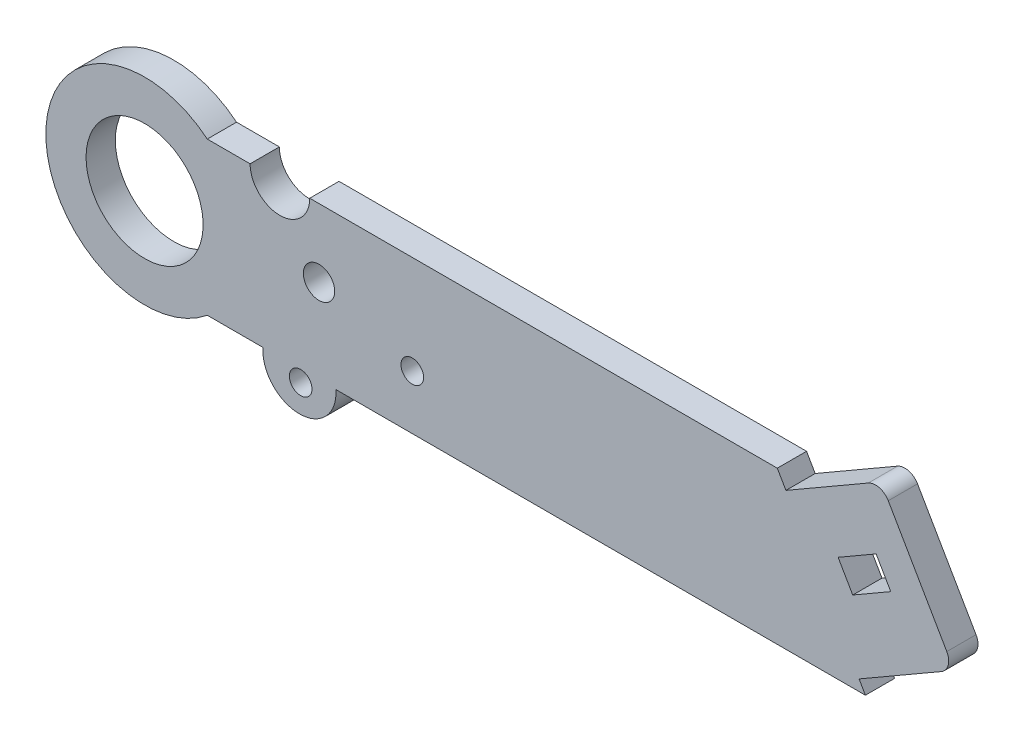
ISO-10303-21;
HEADER;
FILE_DESCRIPTION(('STEP AP214'),'2;1');
FILE_NAME('part.step','',(''),(''),'','','');
FILE_SCHEMA(('AUTOMOTIVE_DESIGN { 1 0 10303 214 1 1 1 1 }'));
ENDSEC;
DATA;
#1=APPLICATION_CONTEXT('core data for automotive mechanical design processes');
#2=APPLICATION_PROTOCOL_DEFINITION('international standard','automotive_design',2000,#1);
#3=PRODUCT_CONTEXT('',#1,'mechanical');
#4=PRODUCT('Part','Part','',(#3));
#5=PRODUCT_RELATED_PRODUCT_CATEGORY('part','',(#4));
#6=PRODUCT_DEFINITION_FORMATION('','',#4);
#7=PRODUCT_DEFINITION_CONTEXT('part definition',#1,'design');
#8=PRODUCT_DEFINITION('design','',#6,#7);
#9=PRODUCT_DEFINITION_SHAPE('','',#8);
#10=(LENGTH_UNIT() NAMED_UNIT(*) SI_UNIT(.MILLI.,.METRE.));
#11=(NAMED_UNIT(*) PLANE_ANGLE_UNIT() SI_UNIT($,.RADIAN.));
#12=(NAMED_UNIT(*) SI_UNIT($,.STERADIAN.) SOLID_ANGLE_UNIT());
#13=UNCERTAINTY_MEASURE_WITH_UNIT(LENGTH_MEASURE(1.E-05),#10,'distance_accuracy_value','');
#14=(GEOMETRIC_REPRESENTATION_CONTEXT(3) GLOBAL_UNCERTAINTY_ASSIGNED_CONTEXT((#13)) GLOBAL_UNIT_ASSIGNED_CONTEXT((#10,
#11,#12)) REPRESENTATION_CONTEXT('',''));
#15=CARTESIAN_POINT('',(0.,0.,0.));
#16=DIRECTION('',(0.,0.,1.));
#17=DIRECTION('',(1.,0.,0.));
#18=AXIS2_PLACEMENT_3D('',#15,#16,#17);
#19=CARTESIAN_POINT('',(28.5705507322346,-10.430515814004,4.));
#20=DIRECTION('',(0.,1.,0.));
#21=DIRECTION('',(-1.,0.,0.));
#22=AXIS2_PLACEMENT_3D('',#19,#20,#21);
#23=PLANE('',#22);
#24=DIRECTION('',(1.,0.,0.));
#25=VECTOR('',#24,1.);
#26=CARTESIAN_POINT('',(28.5705507322346,-10.430515814004,0.));
#27=LINE('',#26,#25);
#28=CARTESIAN_POINT('',(-71.4294492677657,-10.4305158140035,0.));
#29=VERTEX_POINT('',#28);
#30=CARTESIAN_POINT('',(-63.8151403933771,-10.4305158140038,0.));
#31=VERTEX_POINT('',#30);
#32=EDGE_CURVE('E171',#29,#31,#27,.T.);
#33=ORIENTED_EDGE('',*,*,#32,.T.);
#34=DIRECTION('',(0.,0.,1.));
#35=VECTOR('',#34,1.);
#36=CARTESIAN_POINT('',(-63.815140393377,-10.4305158140035,-11.3544213414863));
#37=LINE('',#36,#35);
#38=CARTESIAN_POINT('',(-63.8151403933771,-10.4305158140038,4.));
#39=VERTEX_POINT('',#38);
#40=EDGE_CURVE('E58',#31,#39,#37,.T.);
#41=ORIENTED_EDGE('',*,*,#40,.T.);
#42=DIRECTION('',(1.,0.,0.));
#43=VECTOR('',#42,1.);
#44=CARTESIAN_POINT('',(28.5705507322346,-10.430515814004,4.));
#45=LINE('',#44,#43);
#46=CARTESIAN_POINT('',(-71.4294492677657,-10.4305158140035,4.));
#47=VERTEX_POINT('',#46);
#48=EDGE_CURVE('E297',#47,#39,#45,.T.);
#49=ORIENTED_EDGE('',*,*,#48,.F.);
#50=DIRECTION('',(0.,0.,-1.));
#51=VECTOR('',#50,1.);
#52=CARTESIAN_POINT('',(-71.4294492677657,-10.4305158140035,4.));
#53=LINE('',#52,#51);
#54=EDGE_CURVE('E299',#47,#29,#53,.T.);
#55=ORIENTED_EDGE('',*,*,#54,.T.);
#56=EDGE_LOOP('',(#33,#41,#49,#55));
#57=FACE_BOUND('',#56,.T.);
#58=ADVANCED_FACE('F35',(#57),#23,.F.);
#59=CARTESIAN_POINT('',(28.5705507322346,-2.23779328401008E-13,4.));
#60=DIRECTION('',(0.,0.,-1.));
#61=DIRECTION('',(-1.,0.,0.));
#62=AXIS2_PLACEMENT_3D('',#59,#60,#61);
#63=PLANE('',#62);
#64=CARTESIAN_POINT('',(-58.6634492677657,-12.0125158140035,4.));
#65=DIRECTION('',(0.,0.,1.));
#66=DIRECTION('',(1.,0.,0.));
#67=AXIS2_PLACEMENT_3D('',#64,#65,#66);
#68=CIRCLE('',#67,1.55);
#69=CARTESIAN_POINT('',(-57.1134492677657,-12.0125158140035,4.));
#70=VERTEX_POINT('',#69);
#71=EDGE_CURVE('E181',#70,#70,#68,.T.);
#72=ORIENTED_EDGE('',*,*,#71,.F.);
#73=EDGE_LOOP('',(#72));
#74=FACE_BOUND('',#73,.T.);
#75=CARTESIAN_POINT('',(-43.4044492677657,-3.02551581400346,4.));
#76=DIRECTION('',(0.,0.,1.));
#77=DIRECTION('',(1.,0.,0.));
#78=AXIS2_PLACEMENT_3D('',#75,#76,#77);
#79=CIRCLE('',#78,1.55);
#80=CARTESIAN_POINT('',(-41.8544492677657,-3.02551581400346,4.));
#81=VERTEX_POINT('',#80);
#82=EDGE_CURVE('E458',#81,#81,#79,.T.);
#83=ORIENTED_EDGE('',*,*,#82,.F.);
#84=EDGE_LOOP('',(#83));
#85=FACE_BOUND('',#84,.T.);
#86=CARTESIAN_POINT('',(19.9282032302755,13.1579414541164,4.));
#87=DIRECTION('',(0.,0.,-1.));
#88=DIRECTION('',(-1.,0.,0.));
#89=AXIS2_PLACEMENT_3D('',#86,#87,#88);
#90=CIRCLE('',#89,2.);
#91=CARTESIAN_POINT('',(18.9282032302755,14.8899922616853,4.));
#92=VERTEX_POINT('',#91);
#93=CARTESIAN_POINT('',(21.6602540378444,14.1579414541164,4.));
#94=VERTEX_POINT('',#93);
#95=EDGE_CURVE('E191',#92,#94,#90,.T.);
#96=ORIENTED_EDGE('',*,*,#95,.F.);
#97=DIRECTION('',(0.866025403784439,0.5,0.));
#98=VECTOR('',#97,1.);
#99=CARTESIAN_POINT('',(18.9282032302755,14.8899922616853,4.));
#100=LINE('',#99,#98);
#101=CARTESIAN_POINT('',(7.66987298107778,8.38999226168531,4.));
#102=VERTEX_POINT('',#101);
#103=EDGE_CURVE('E200',#102,#92,#100,.T.);
#104=ORIENTED_EDGE('',*,*,#103,.F.);
#105=DIRECTION('',(0.5,-0.866025403784439,0.));
#106=VECTOR('',#105,1.);
#107=CARTESIAN_POINT('',(5.71913664723049,11.7687667040795,4.));
#108=LINE('',#107,#106);
#109=CARTESIAN_POINT('',(6.49177615885906,10.4305158140036,4.));
#110=VERTEX_POINT('',#109);
#111=EDGE_CURVE('E241',#110,#102,#108,.T.);
#112=ORIENTED_EDGE('',*,*,#111,.F.);
#113=DIRECTION('',(-1.,0.,0.));
#114=VECTOR('',#113,1.);
#115=CARTESIAN_POINT('',(-57.4234990357657,10.4305158140038,4.));
#116=LINE('',#115,#114);
#117=CARTESIAN_POINT('',(-57.4234990357657,10.4305158140038,4.));
#118=VERTEX_POINT('',#117);
#119=EDGE_CURVE('E289',#110,#118,#116,.T.);
#120=ORIENTED_EDGE('',*,*,#119,.T.);
#121=CARTESIAN_POINT('',(-61.4993944199065,10.4305158140038,4.));
#122=DIRECTION('',(0.,0.,-1.));
#123=DIRECTION('',(1.,0.,0.));
#124=AXIS2_PLACEMENT_3D('',#121,#122,#123);
#125=CIRCLE('',#124,4.07589538414074);
#126=CARTESIAN_POINT('',(-65.5752898040472,10.4305158140038,4.));
#127=VERTEX_POINT('',#126);
#128=EDGE_CURVE('E291',#118,#127,#125,.T.);
#129=ORIENTED_EDGE('',*,*,#128,.T.);
#130=DIRECTION('',(-1.,0.,0.));
#131=VECTOR('',#130,1.);
#132=CARTESIAN_POINT('',(-71.4294492677654,10.4305158140038,4.));
#133=LINE('',#132,#131);
#134=CARTESIAN_POINT('',(-71.4294492677654,10.4305158140038,4.));
#135=VERTEX_POINT('',#134);
#136=EDGE_CURVE('E293',#127,#135,#133,.T.);
#137=ORIENTED_EDGE('',*,*,#136,.T.);
#138=CARTESIAN_POINT('',(-80.0000000000002,4.8919202022546E-13,4.));
#139=DIRECTION('',(0.,0.,1.));
#140=DIRECTION('',(1.,0.,0.));
#141=AXIS2_PLACEMENT_3D('',#138,#139,#140);
#142=CIRCLE('',#141,13.4999999999997);
#143=EDGE_CURVE('E295',#135,#47,#142,.T.);
#144=ORIENTED_EDGE('',*,*,#143,.T.);
#145=ORIENTED_EDGE('',*,*,#48,.T.);
#146=CARTESIAN_POINT('',(-58.8294492677657,-10.8085158140035,4.));
#147=DIRECTION('',(0.,0.,1.));
#148=DIRECTION('',(1.,0.,0.));
#149=AXIS2_PLACEMENT_3D('',#146,#147,#148);
#150=CIRCLE('',#149,5.);
#151=CARTESIAN_POINT('',(-53.8437581421543,-10.4305158140038,4.));
#152=VERTEX_POINT('',#151);
#153=EDGE_CURVE('E188',#39,#152,#150,.T.);
#154=ORIENTED_EDGE('',*,*,#153,.T.);
#155=CARTESIAN_POINT('',(18.5358983848625,-10.4305158140039,4.));
#156=VERTEX_POINT('',#155);
#157=EDGE_CURVE('E50',#152,#156,#45,.T.);
#158=ORIENTED_EDGE('',*,*,#157,.T.);
#159=DIRECTION('',(0.5,-0.866025403784439,0.));
#160=VECTOR('',#159,1.);
#161=CARTESIAN_POINT('',(17.6698729810778,-8.93051581400346,4.));
#162=LINE('',#161,#160);
#163=CARTESIAN_POINT('',(17.6698729810778,-8.93051581400346,4.));
#164=VERTEX_POINT('',#163);
#165=EDGE_CURVE('E225',#164,#156,#162,.T.);
#166=ORIENTED_EDGE('',*,*,#165,.F.);
#167=DIRECTION('',(-0.866025403784438,-0.5,0.));
#168=VECTOR('',#167,1.);
#169=CARTESIAN_POINT('',(17.6698729810778,-8.93051581400346,4.));
#170=LINE('',#169,#168);
#171=CARTESIAN_POINT('',(28.9282032302755,-2.43051581400346,4.));
#172=VERTEX_POINT('',#171);
#173=EDGE_CURVE('E222',#172,#164,#170,.T.);
#174=ORIENTED_EDGE('',*,*,#173,.F.);
#175=CARTESIAN_POINT('',(27.9282032302755,-0.698465006434585,4.));
#176=DIRECTION('',(0.,0.,-1.));
#177=DIRECTION('',(-1.,0.,0.));
#178=AXIS2_PLACEMENT_3D('',#175,#176,#177);
#179=CIRCLE('',#178,2.);
#180=CARTESIAN_POINT('',(29.6602540378444,0.301534993565415,4.));
#181=VERTEX_POINT('',#180);
#182=EDGE_CURVE('E198',#181,#172,#179,.T.);
#183=ORIENTED_EDGE('',*,*,#182,.F.);
#184=DIRECTION('',(0.5,-0.866025403784439,0.));
#185=VECTOR('',#184,1.);
#186=CARTESIAN_POINT('',(21.6602540378444,14.1579414541164,4.));
#187=LINE('',#186,#185);
#188=EDGE_CURVE('E194',#94,#181,#187,.T.);
#189=ORIENTED_EDGE('',*,*,#188,.F.);
#190=EDGE_LOOP('',(#96,#104,#112,#120,#129,#137,#144,#145,#154,#158,#166,#174,#183,#189));
#191=FACE_BOUND('',#190,.T.);
#192=CARTESIAN_POINT('',(-56.1528243140113,1.10586946070457,4.));
#193=DIRECTION('',(0.,0.,1.));
#194=DIRECTION('',(1.,0.,0.));
#195=AXIS2_PLACEMENT_3D('',#192,#193,#194);
#196=CIRCLE('',#195,2.14132169694266);
#197=CARTESIAN_POINT('',(-54.0115026170686,1.10586946070457,4.));
#198=VERTEX_POINT('',#197);
#199=EDGE_CURVE('E256',#198,#198,#196,.T.);
#200=ORIENTED_EDGE('',*,*,#199,.F.);
#201=EDGE_LOOP('',(#200));
#202=FACE_BOUND('',#201,.T.);
#203=DIRECTION('',(0.866025403784436,0.500000000000004,0.));
#204=VECTOR('',#203,1.);
#205=CARTESIAN_POINT('',(14.8038475772934,4.03358580113426,4.));
#206=LINE('',#205,#204);
#207=CARTESIAN_POINT('',(14.8038475772934,4.03358580113426,4.));
#208=VERTEX_POINT('',#207);
#209=CARTESIAN_POINT('',(20.,7.03358580113428,4.));
#210=VERTEX_POINT('',#209);
#211=EDGE_CURVE('E280',#208,#210,#206,.T.);
#212=ORIENTED_EDGE('',*,*,#211,.T.);
#213=DIRECTION('',(0.500000000000004,-0.866025403784436,0.));
#214=VECTOR('',#213,1.);
#215=CARTESIAN_POINT('',(20.,7.03358580113428,4.));
#216=LINE('',#215,#214);
#217=CARTESIAN_POINT('',(22.,3.56948418599654,4.));
#218=VERTEX_POINT('',#217);
#219=EDGE_CURVE('E277',#210,#218,#216,.T.);
#220=ORIENTED_EDGE('',*,*,#219,.T.);
#221=DIRECTION('',(0.866025403784436,0.500000000000005,0.));
#222=VECTOR('',#221,1.);
#223=CARTESIAN_POINT('',(16.8038475772934,0.569484185996512,4.));
#224=LINE('',#223,#222);
#225=CARTESIAN_POINT('',(16.8038475772934,0.569484185996512,4.));
#226=VERTEX_POINT('',#225);
#227=EDGE_CURVE('E274',#226,#218,#224,.T.);
#228=ORIENTED_EDGE('',*,*,#227,.F.);
#229=DIRECTION('',(0.500000000000005,-0.866025403784436,0.));
#230=VECTOR('',#229,1.);
#231=CARTESIAN_POINT('',(14.8038475772934,4.03358580113426,4.));
#232=LINE('',#231,#230);
#233=EDGE_CURVE('E271',#208,#226,#232,.T.);
#234=ORIENTED_EDGE('',*,*,#233,.F.);
#235=EDGE_LOOP('',(#212,#220,#228,#234));
#236=FACE_BOUND('',#235,.T.);
#237=CARTESIAN_POINT('',(-80.,0.,4.));
#238=DIRECTION('',(0.,0.,-1.));
#239=DIRECTION('',(-1.,0.,0.));
#240=AXIS2_PLACEMENT_3D('',#237,#238,#239);
#241=CIRCLE('',#240,8.);
#242=CARTESIAN_POINT('',(-88.,0.,4.));
#243=VERTEX_POINT('',#242);
#244=EDGE_CURVE('E246',#243,#243,#241,.T.);
#245=ORIENTED_EDGE('',*,*,#244,.T.);
#246=EDGE_LOOP('',(#245));
#247=FACE_BOUND('',#246,.T.);
#248=ADVANCED_FACE('F328',(#74,#85,#191,#202,#236,#247),#63,.F.);
#249=CARTESIAN_POINT('',(28.5705507322346,-2.23779328401008E-13,0.));
#250=DIRECTION('',(0.,0.,-1.));
#251=DIRECTION('',(-1.,0.,0.));
#252=AXIS2_PLACEMENT_3D('',#249,#250,#251);
#253=PLANE('',#252);
#254=CARTESIAN_POINT('',(-58.6634492677657,-12.0125158140035,0.));
#255=DIRECTION('',(0.,0.,-1.));
#256=DIRECTION('',(-1.,0.,0.));
#257=AXIS2_PLACEMENT_3D('',#254,#255,#256);
#258=CIRCLE('',#257,1.55);
#259=CARTESIAN_POINT('',(-60.2134492677657,-12.0125158140035,0.));
#260=VERTEX_POINT('',#259);
#261=EDGE_CURVE('E184',#260,#260,#258,.F.);
#262=ORIENTED_EDGE('',*,*,#261,.T.);
#263=EDGE_LOOP('',(#262));
#264=FACE_BOUND('',#263,.T.);
#265=CARTESIAN_POINT('',(-43.4044492677657,-3.02551581400346,0.));
#266=DIRECTION('',(0.,0.,-1.));
#267=DIRECTION('',(-1.,0.,0.));
#268=AXIS2_PLACEMENT_3D('',#265,#266,#267);
#269=CIRCLE('',#268,1.55);
#270=CARTESIAN_POINT('',(-44.9544492677657,-3.02551581400346,0.));
#271=VERTEX_POINT('',#270);
#272=EDGE_CURVE('E455',#271,#271,#269,.F.);
#273=ORIENTED_EDGE('',*,*,#272,.T.);
#274=EDGE_LOOP('',(#273));
#275=FACE_BOUND('',#274,.T.);
#276=DIRECTION('',(0.866025403784439,0.5,0.));
#277=VECTOR('',#276,1.);
#278=CARTESIAN_POINT('',(18.9282032302755,14.8899922616853,0.));
#279=LINE('',#278,#277);
#280=CARTESIAN_POINT('',(7.66987298107778,8.38999226168531,0.));
#281=VERTEX_POINT('',#280);
#282=CARTESIAN_POINT('',(18.9282032302755,14.8899922616853,0.));
#283=VERTEX_POINT('',#282);
#284=EDGE_CURVE('E238',#281,#283,#279,.T.);
#285=ORIENTED_EDGE('',*,*,#284,.T.);
#286=CARTESIAN_POINT('',(19.9282032302755,13.1579414541164,0.));
#287=DIRECTION('',(0.,0.,1.));
#288=DIRECTION('',(-1.,0.,0.));
#289=AXIS2_PLACEMENT_3D('',#286,#287,#288);
#290=CIRCLE('',#289,2.);
#291=CARTESIAN_POINT('',(21.6602540378444,14.1579414541164,0.));
#292=VERTEX_POINT('',#291);
#293=EDGE_CURVE('E207',#292,#283,#290,.T.);
#294=ORIENTED_EDGE('',*,*,#293,.F.);
#295=DIRECTION('',(-0.5,0.866025403784439,0.));
#296=VECTOR('',#295,1.);
#297=CARTESIAN_POINT('',(21.6602540378444,14.1579414541164,0.));
#298=LINE('',#297,#296);
#299=CARTESIAN_POINT('',(29.6602540378444,0.301534993565416,0.));
#300=VERTEX_POINT('',#299);
#301=EDGE_CURVE('E204',#300,#292,#298,.T.);
#302=ORIENTED_EDGE('',*,*,#301,.F.);
#303=CARTESIAN_POINT('',(27.9282032302755,-0.698465006434585,0.));
#304=DIRECTION('',(0.,0.,1.));
#305=DIRECTION('',(1.,0.,0.));
#306=AXIS2_PLACEMENT_3D('',#303,#304,#305);
#307=CIRCLE('',#306,2.);
#308=CARTESIAN_POINT('',(28.9282032302755,-2.43051581400346,0.));
#309=VERTEX_POINT('',#308);
#310=EDGE_CURVE('E201',#309,#300,#307,.T.);
#311=ORIENTED_EDGE('',*,*,#310,.F.);
#312=DIRECTION('',(-0.866025403784438,-0.5,0.));
#313=VECTOR('',#312,1.);
#314=CARTESIAN_POINT('',(17.6698729810778,-8.93051581400346,0.));
#315=LINE('',#314,#313);
#316=CARTESIAN_POINT('',(17.6698729810778,-8.93051581400346,0.));
#317=VERTEX_POINT('',#316);
#318=EDGE_CURVE('E218',#309,#317,#315,.T.);
#319=ORIENTED_EDGE('',*,*,#318,.T.);
#320=DIRECTION('',(0.5,-0.866025403784439,0.));
#321=VECTOR('',#320,1.);
#322=CARTESIAN_POINT('',(17.6698729810778,-8.93051581400346,0.));
#323=LINE('',#322,#321);
#324=CARTESIAN_POINT('',(18.5358983848625,-10.4305158140039,0.));
#325=VERTEX_POINT('',#324);
#326=EDGE_CURVE('E169',#317,#325,#323,.T.);
#327=ORIENTED_EDGE('',*,*,#326,.T.);
#328=CARTESIAN_POINT('',(-53.8437581421543,-10.4305158140035,0.));
#329=VERTEX_POINT('',#328);
#330=EDGE_CURVE('E162',#329,#325,#27,.T.);
#331=ORIENTED_EDGE('',*,*,#330,.F.);
#332=CARTESIAN_POINT('',(-58.8294492677657,-10.8085158140035,0.));
#333=DIRECTION('',(0.,0.,-1.));
#334=DIRECTION('',(-1.,0.,0.));
#335=AXIS2_PLACEMENT_3D('',#332,#333,#334);
#336=CIRCLE('',#335,5.);
#337=EDGE_CURVE('E167',#31,#329,#336,.F.);
#338=ORIENTED_EDGE('',*,*,#337,.F.);
#339=ORIENTED_EDGE('',*,*,#32,.F.);
#340=CARTESIAN_POINT('',(-80.0000000000002,4.8919202022546E-13,0.));
#341=DIRECTION('',(0.,0.,1.));
#342=DIRECTION('',(1.,0.,0.));
#343=AXIS2_PLACEMENT_3D('',#340,#341,#342);
#344=CIRCLE('',#343,13.4999999999997);
#345=CARTESIAN_POINT('',(-71.4294492677654,10.4305158140038,0.));
#346=VERTEX_POINT('',#345);
#347=EDGE_CURVE('E172',#346,#29,#344,.T.);
#348=ORIENTED_EDGE('',*,*,#347,.F.);
#349=DIRECTION('',(-1.,0.,0.));
#350=VECTOR('',#349,1.);
#351=CARTESIAN_POINT('',(-71.4294492677654,10.4305158140038,0.));
#352=LINE('',#351,#350);
#353=CARTESIAN_POINT('',(-65.5752898040472,10.4305158140038,0.));
#354=VERTEX_POINT('',#353);
#355=EDGE_CURVE('E303',#354,#346,#352,.T.);
#356=ORIENTED_EDGE('',*,*,#355,.F.);
#357=CARTESIAN_POINT('',(-61.4993944199065,10.4305158140038,0.));
#358=DIRECTION('',(0.,0.,-1.));
#359=DIRECTION('',(1.,0.,0.));
#360=AXIS2_PLACEMENT_3D('',#357,#358,#359);
#361=CIRCLE('',#360,4.07589538414074);
#362=CARTESIAN_POINT('',(-57.4234990357657,10.4305158140038,0.));
#363=VERTEX_POINT('',#362);
#364=EDGE_CURVE('E301',#363,#354,#361,.T.);
#365=ORIENTED_EDGE('',*,*,#364,.F.);
#366=DIRECTION('',(-1.,0.,0.));
#367=VECTOR('',#366,1.);
#368=CARTESIAN_POINT('',(-57.4234990357657,10.4305158140038,0.));
#369=LINE('',#368,#367);
#370=CARTESIAN_POINT('',(6.49177615885907,10.4305158140036,0.));
#371=VERTEX_POINT('',#370);
#372=EDGE_CURVE('E253',#371,#363,#369,.T.);
#373=ORIENTED_EDGE('',*,*,#372,.F.);
#374=DIRECTION('',(0.5,-0.866025403784439,0.));
#375=VECTOR('',#374,1.);
#376=CARTESIAN_POINT('',(5.71913664723049,11.7687667040795,0.));
#377=LINE('',#376,#375);
#378=EDGE_CURVE('E234',#371,#281,#377,.T.);
#379=ORIENTED_EDGE('',*,*,#378,.T.);
#380=EDGE_LOOP('',(#285,#294,#302,#311,#319,#327,#331,#338,#339,#348,#356,#365,#373,#379));
#381=FACE_BOUND('',#380,.T.);
#382=DIRECTION('',(0.500000000000004,-0.866025403784436,0.));
#383=VECTOR('',#382,1.);
#384=CARTESIAN_POINT('',(20.,7.03358580113428,0.));
#385=LINE('',#384,#383);
#386=CARTESIAN_POINT('',(20.,7.03358580113428,0.));
#387=VERTEX_POINT('',#386);
#388=CARTESIAN_POINT('',(22.,3.56948418599654,0.));
#389=VERTEX_POINT('',#388);
#390=EDGE_CURVE('E285',#387,#389,#385,.T.);
#391=ORIENTED_EDGE('',*,*,#390,.F.);
#392=DIRECTION('',(0.866025403784436,0.500000000000004,0.));
#393=VECTOR('',#392,1.);
#394=CARTESIAN_POINT('',(14.8038475772934,4.03358580113426,0.));
#395=LINE('',#394,#393);
#396=CARTESIAN_POINT('',(14.8038475772934,4.03358580113426,0.));
#397=VERTEX_POINT('',#396);
#398=EDGE_CURVE('E283',#397,#387,#395,.T.);
#399=ORIENTED_EDGE('',*,*,#398,.F.);
#400=DIRECTION('',(0.500000000000005,-0.866025403784436,0.));
#401=VECTOR('',#400,1.);
#402=CARTESIAN_POINT('',(14.8038475772934,4.03358580113426,0.));
#403=LINE('',#402,#401);
#404=CARTESIAN_POINT('',(16.8038475772934,0.569484185996512,0.));
#405=VERTEX_POINT('',#404);
#406=EDGE_CURVE('E231',#397,#405,#403,.T.);
#407=ORIENTED_EDGE('',*,*,#406,.T.);
#408=DIRECTION('',(0.866025403784436,0.500000000000005,0.));
#409=VECTOR('',#408,1.);
#410=CARTESIAN_POINT('',(16.8038475772934,0.569484185996512,0.));
#411=LINE('',#410,#409);
#412=EDGE_CURVE('E259',#405,#389,#411,.T.);
#413=ORIENTED_EDGE('',*,*,#412,.T.);
#414=EDGE_LOOP('',(#391,#399,#407,#413));
#415=FACE_BOUND('',#414,.T.);
#416=CARTESIAN_POINT('',(-56.1528243140113,1.10586946070457,0.));
#417=DIRECTION('',(0.,0.,-1.));
#418=DIRECTION('',(-1.,0.,0.));
#419=AXIS2_PLACEMENT_3D('',#416,#417,#418);
#420=CIRCLE('',#419,2.14132169694266);
#421=CARTESIAN_POINT('',(-58.294146010954,1.10586946070457,0.));
#422=VERTEX_POINT('',#421);
#423=EDGE_CURVE('E250',#422,#422,#420,.F.);
#424=ORIENTED_EDGE('',*,*,#423,.T.);
#425=EDGE_LOOP('',(#424));
#426=FACE_BOUND('',#425,.T.);
#427=CARTESIAN_POINT('',(-80.,0.,0.));
#428=DIRECTION('',(0.,0.,-1.));
#429=DIRECTION('',(-1.,0.,0.));
#430=AXIS2_PLACEMENT_3D('',#427,#428,#429);
#431=CIRCLE('',#430,8.);
#432=CARTESIAN_POINT('',(-88.,0.,0.));
#433=VERTEX_POINT('',#432);
#434=EDGE_CURVE('E249',#433,#433,#431,.T.);
#435=ORIENTED_EDGE('',*,*,#434,.F.);
#436=EDGE_LOOP('',(#435));
#437=FACE_BOUND('',#436,.T.);
#438=ADVANCED_FACE('F163',(#264,#275,#381,#415,#426,#437),#253,.T.);
#439=CARTESIAN_POINT('',(-57.4234990357657,10.4305158140038,4.));
#440=DIRECTION('',(0.,-1.,0.));
#441=DIRECTION('',(1.,0.,0.));
#442=AXIS2_PLACEMENT_3D('',#439,#440,#441);
#443=PLANE('',#442);
#444=ORIENTED_EDGE('',*,*,#119,.F.);
#445=DIRECTION('',(0.,0.,1.));
#446=VECTOR('',#445,1.);
#447=CARTESIAN_POINT('',(6.49177615885906,10.4305158140036,-0.00100000000000013));
#448=LINE('',#447,#446);
#449=EDGE_CURVE('E219',#371,#110,#448,.T.);
#450=ORIENTED_EDGE('',*,*,#449,.F.);
#451=ORIENTED_EDGE('',*,*,#372,.T.);
#452=DIRECTION('',(0.,0.,-1.));
#453=VECTOR('',#452,1.);
#454=CARTESIAN_POINT('',(-57.4234990357657,10.4305158140038,4.));
#455=LINE('',#454,#453);
#456=EDGE_CURVE('E11',#118,#363,#455,.T.);
#457=ORIENTED_EDGE('',*,*,#456,.F.);
#458=EDGE_LOOP('',(#444,#450,#451,#457));
#459=FACE_BOUND('',#458,.T.);
#460=ADVANCED_FACE('F37',(#459),#443,.F.);
#461=CARTESIAN_POINT('',(-61.4993944199065,10.4305158140038,4.));
#462=DIRECTION('',(0.,0.,-1.));
#463=DIRECTION('',(-1.,0.,0.));
#464=AXIS2_PLACEMENT_3D('',#461,#462,#463);
#465=CYLINDRICAL_SURFACE('',#464,4.07589538414074);
#466=ORIENTED_EDGE('',*,*,#364,.T.);
#467=DIRECTION('',(0.,0.,-1.));
#468=VECTOR('',#467,1.);
#469=CARTESIAN_POINT('',(-65.5752898040472,10.4305158140038,4.));
#470=LINE('',#469,#468);
#471=EDGE_CURVE('E43',#127,#354,#470,.T.);
#472=ORIENTED_EDGE('',*,*,#471,.F.);
#473=ORIENTED_EDGE('',*,*,#128,.F.);
#474=ORIENTED_EDGE('',*,*,#456,.T.);
#475=EDGE_LOOP('',(#466,#472,#473,#474));
#476=FACE_BOUND('',#475,.T.);
#477=ADVANCED_FACE('F333',(#476),#465,.F.);
#478=CARTESIAN_POINT('',(-71.4294492677654,10.4305158140038,4.));
#479=DIRECTION('',(0.,-1.,0.));
#480=DIRECTION('',(1.,0.,0.));
#481=AXIS2_PLACEMENT_3D('',#478,#479,#480);
#482=PLANE('',#481);
#483=ORIENTED_EDGE('',*,*,#355,.T.);
#484=DIRECTION('',(0.,0.,-1.));
#485=VECTOR('',#484,1.);
#486=CARTESIAN_POINT('',(-71.4294492677654,10.4305158140038,4.));
#487=LINE('',#486,#485);
#488=EDGE_CURVE('E308',#135,#346,#487,.T.);
#489=ORIENTED_EDGE('',*,*,#488,.F.);
#490=ORIENTED_EDGE('',*,*,#136,.F.);
#491=ORIENTED_EDGE('',*,*,#471,.T.);
#492=EDGE_LOOP('',(#483,#489,#490,#491));
#493=FACE_BOUND('',#492,.T.);
#494=ADVANCED_FACE('F315',(#493),#482,.F.);
#495=CARTESIAN_POINT('',(-80.0000000000002,4.8919202022546E-13,4.));
#496=DIRECTION('',(0.,0.,-1.));
#497=DIRECTION('',(-1.,0.,0.));
#498=AXIS2_PLACEMENT_3D('',#495,#496,#497);
#499=CYLINDRICAL_SURFACE('',#498,13.4999999999997);
#500=ORIENTED_EDGE('',*,*,#347,.T.);
#501=ORIENTED_EDGE('',*,*,#54,.F.);
#502=ORIENTED_EDGE('',*,*,#143,.F.);
#503=ORIENTED_EDGE('',*,*,#488,.T.);
#504=EDGE_LOOP('',(#500,#501,#502,#503));
#505=FACE_BOUND('',#504,.T.);
#506=ADVANCED_FACE('F324',(#505),#499,.T.);
#507=ORIENTED_EDGE('',*,*,#157,.F.);
#508=DIRECTION('',(0.,0.,1.));
#509=VECTOR('',#508,1.);
#510=CARTESIAN_POINT('',(-53.8437581421543,-10.4305158140035,-11.3544213414863));
#511=LINE('',#510,#509);
#512=EDGE_CURVE('E174',#329,#152,#511,.T.);
#513=ORIENTED_EDGE('',*,*,#512,.F.);
#514=ORIENTED_EDGE('',*,*,#330,.T.);
#515=DIRECTION('',(0.,0.,-1.));
#516=VECTOR('',#515,1.);
#517=CARTESIAN_POINT('',(18.5358983848625,-10.4305158140039,-0.00100000000000013));
#518=LINE('',#517,#516);
#519=EDGE_CURVE('E216',#156,#325,#518,.T.);
#520=ORIENTED_EDGE('',*,*,#519,.F.);
#521=EDGE_LOOP('',(#507,#513,#514,#520));
#522=FACE_BOUND('',#521,.T.);
#523=ADVANCED_FACE('F175',(#522),#23,.F.);
#524=CARTESIAN_POINT('',(14.8038475772934,4.03358580113426,-0.00100000000000013));
#525=DIRECTION('',(0.500000000000004,-0.866025403784436,0.));
#526=DIRECTION('',(0.866025403784436,0.500000000000004,0.));
#527=AXIS2_PLACEMENT_3D('',#524,#525,#526);
#528=PLANE('',#527);
#529=ORIENTED_EDGE('',*,*,#398,.T.);
#530=DIRECTION('',(0.,0.,1.));
#531=VECTOR('',#530,1.);
#532=CARTESIAN_POINT('',(20.,7.03358580113428,-0.00100000000000013));
#533=LINE('',#532,#531);
#534=EDGE_CURVE('E262',#387,#210,#533,.T.);
#535=ORIENTED_EDGE('',*,*,#534,.T.);
#536=ORIENTED_EDGE('',*,*,#211,.F.);
#537=DIRECTION('',(0.,0.,1.));
#538=VECTOR('',#537,1.);
#539=CARTESIAN_POINT('',(14.8038475772934,4.03358580113426,-0.00100000000000013));
#540=LINE('',#539,#538);
#541=EDGE_CURVE('E268',#397,#208,#540,.T.);
#542=ORIENTED_EDGE('',*,*,#541,.F.);
#543=EDGE_LOOP('',(#529,#535,#536,#542));
#544=FACE_BOUND('',#543,.T.);
#545=ADVANCED_FACE('F383',(#544),#528,.T.);
#546=CARTESIAN_POINT('',(20.,7.03358580113428,-0.00100000000000013));
#547=DIRECTION('',(-0.866025403784436,-0.500000000000004,0.));
#548=DIRECTION('',(0.500000000000004,-0.866025403784436,0.));
#549=AXIS2_PLACEMENT_3D('',#546,#547,#548);
#550=PLANE('',#549);
#551=ORIENTED_EDGE('',*,*,#390,.T.);
#552=DIRECTION('',(0.,0.,1.));
#553=VECTOR('',#552,1.);
#554=CARTESIAN_POINT('',(22.,3.56948418599654,-0.00100000000000013));
#555=LINE('',#554,#553);
#556=EDGE_CURVE('E264',#389,#218,#555,.T.);
#557=ORIENTED_EDGE('',*,*,#556,.T.);
#558=ORIENTED_EDGE('',*,*,#219,.F.);
#559=ORIENTED_EDGE('',*,*,#534,.F.);
#560=EDGE_LOOP('',(#551,#557,#558,#559));
#561=FACE_BOUND('',#560,.T.);
#562=ADVANCED_FACE('F388',(#561),#550,.T.);
#563=CARTESIAN_POINT('',(16.8038475772934,0.569484185996512,-0.00100000000000013));
#564=DIRECTION('',(0.500000000000005,-0.866025403784436,0.));
#565=DIRECTION('',(0.866025403784436,0.500000000000005,0.));
#566=AXIS2_PLACEMENT_3D('',#563,#564,#565);
#567=PLANE('',#566);
#568=DIRECTION('',(0.,0.,1.));
#569=VECTOR('',#568,1.);
#570=CARTESIAN_POINT('',(16.8038475772934,0.569484185996512,-0.00100000000000013));
#571=LINE('',#570,#569);
#572=EDGE_CURVE('E266',#405,#226,#571,.T.);
#573=ORIENTED_EDGE('',*,*,#572,.T.);
#574=ORIENTED_EDGE('',*,*,#227,.T.);
#575=ORIENTED_EDGE('',*,*,#556,.F.);
#576=ORIENTED_EDGE('',*,*,#412,.F.);
#577=EDGE_LOOP('',(#573,#574,#575,#576));
#578=FACE_BOUND('',#577,.T.);
#579=ADVANCED_FACE('F414',(#578),#567,.F.);
#580=CARTESIAN_POINT('',(14.8038475772934,4.03358580113426,-0.00100000000000013));
#581=DIRECTION('',(-0.866025403784436,-0.500000000000005,0.));
#582=DIRECTION('',(0.500000000000005,-0.866025403784436,0.));
#583=AXIS2_PLACEMENT_3D('',#580,#581,#582);
#584=PLANE('',#583);
#585=ORIENTED_EDGE('',*,*,#541,.T.);
#586=ORIENTED_EDGE('',*,*,#233,.T.);
#587=ORIENTED_EDGE('',*,*,#572,.F.);
#588=ORIENTED_EDGE('',*,*,#406,.F.);
#589=EDGE_LOOP('',(#585,#586,#587,#588));
#590=FACE_BOUND('',#589,.T.);
#591=ADVANCED_FACE('F410',(#590),#584,.F.);
#592=CARTESIAN_POINT('',(-56.1528243140113,1.10586946070457,-0.00100000000000013));
#593=DIRECTION('',(0.,0.,1.));
#594=DIRECTION('',(1.,0.,0.));
#595=AXIS2_PLACEMENT_3D('',#592,#593,#594);
#596=CYLINDRICAL_SURFACE('',#595,2.14132169694266);
#597=ORIENTED_EDGE('',*,*,#423,.F.);
#598=EDGE_LOOP('',(#597));
#599=FACE_BOUND('',#598,.T.);
#600=ORIENTED_EDGE('',*,*,#199,.T.);
#601=EDGE_LOOP('',(#600));
#602=FACE_BOUND('',#601,.T.);
#603=ADVANCED_FACE('F413',(#599,#602),#596,.F.);
#604=CARTESIAN_POINT('',(-80.,0.,-0.00100000000000013));
#605=DIRECTION('',(0.,0.,1.));
#606=DIRECTION('',(1.,0.,0.));
#607=AXIS2_PLACEMENT_3D('',#604,#605,#606);
#608=CYLINDRICAL_SURFACE('',#607,8.);
#609=ORIENTED_EDGE('',*,*,#434,.T.);
#610=EDGE_LOOP('',(#609));
#611=FACE_BOUND('',#610,.T.);
#612=ORIENTED_EDGE('',*,*,#244,.F.);
#613=EDGE_LOOP('',(#612));
#614=FACE_BOUND('',#613,.T.);
#615=ADVANCED_FACE('F369',(#611,#614),#608,.F.);
#616=CARTESIAN_POINT('',(17.6698729810778,-8.93051581400346,-0.00100000000000013));
#617=DIRECTION('',(-0.5,0.866025403784439,0.));
#618=DIRECTION('',(-0.866025403784438,-0.5,0.));
#619=AXIS2_PLACEMENT_3D('',#616,#617,#618);
#620=PLANE('',#619);
#621=DIRECTION('',(0.,0.,1.));
#622=VECTOR('',#621,1.);
#623=CARTESIAN_POINT('',(28.9282032302755,-2.43051581400346,-0.00100000000000013));
#624=LINE('',#623,#622);
#625=EDGE_CURVE('E228',#309,#172,#624,.T.);
#626=ORIENTED_EDGE('',*,*,#625,.T.);
#627=ORIENTED_EDGE('',*,*,#173,.T.);
#628=DIRECTION('',(0.,0.,1.));
#629=VECTOR('',#628,1.);
#630=CARTESIAN_POINT('',(17.6698729810778,-8.93051581400346,-0.00100000000000013));
#631=LINE('',#630,#629);
#632=EDGE_CURVE('E229',#317,#164,#631,.T.);
#633=ORIENTED_EDGE('',*,*,#632,.F.);
#634=ORIENTED_EDGE('',*,*,#318,.F.);
#635=EDGE_LOOP('',(#626,#627,#633,#634));
#636=FACE_BOUND('',#635,.T.);
#637=ADVANCED_FACE('F357',(#636),#620,.F.);
#638=CARTESIAN_POINT('',(17.6698729810778,-8.93051581400346,-0.00100000000000013));
#639=DIRECTION('',(-0.866025403784439,-0.5,0.));
#640=DIRECTION('',(0.5,-0.866025403784439,0.));
#641=AXIS2_PLACEMENT_3D('',#638,#639,#640);
#642=PLANE('',#641);
#643=ORIENTED_EDGE('',*,*,#632,.T.);
#644=ORIENTED_EDGE('',*,*,#165,.T.);
#645=ORIENTED_EDGE('',*,*,#519,.T.);
#646=ORIENTED_EDGE('',*,*,#326,.F.);
#647=EDGE_LOOP('',(#643,#644,#645,#646));
#648=FACE_BOUND('',#647,.T.);
#649=ADVANCED_FACE('F361',(#648),#642,.F.);
#650=CARTESIAN_POINT('',(18.9282032302755,14.8899922616853,-0.00100000000000013));
#651=DIRECTION('',(0.5,-0.866025403784439,0.));
#652=DIRECTION('',(0.866025403784439,0.5,0.));
#653=AXIS2_PLACEMENT_3D('',#650,#651,#652);
#654=PLANE('',#653);
#655=DIRECTION('',(0.,0.,1.));
#656=VECTOR('',#655,1.);
#657=CARTESIAN_POINT('',(7.66987298107778,8.38999226168531,-0.00100000000000013));
#658=LINE('',#657,#656);
#659=EDGE_CURVE('E237',#281,#102,#658,.T.);
#660=ORIENTED_EDGE('',*,*,#659,.T.);
#661=ORIENTED_EDGE('',*,*,#103,.T.);
#662=DIRECTION('',(0.,0.,-1.));
#663=VECTOR('',#662,1.);
#664=CARTESIAN_POINT('',(18.9282032302755,14.8899922616853,29.6893654038141));
#665=LINE('',#664,#663);
#666=EDGE_CURVE('E210',#92,#283,#665,.T.);
#667=ORIENTED_EDGE('',*,*,#666,.T.);
#668=ORIENTED_EDGE('',*,*,#284,.F.);
#669=EDGE_LOOP('',(#660,#661,#667,#668));
#670=FACE_BOUND('',#669,.T.);
#671=ADVANCED_FACE('F342',(#670),#654,.F.);
#672=CARTESIAN_POINT('',(5.71913664723049,11.7687667040795,-0.00100000000000013));
#673=DIRECTION('',(-0.866025403784439,-0.5,0.));
#674=DIRECTION('',(0.5,-0.866025403784439,0.));
#675=AXIS2_PLACEMENT_3D('',#672,#673,#674);
#676=PLANE('',#675);
#677=ORIENTED_EDGE('',*,*,#449,.T.);
#678=ORIENTED_EDGE('',*,*,#111,.T.);
#679=ORIENTED_EDGE('',*,*,#659,.F.);
#680=ORIENTED_EDGE('',*,*,#378,.F.);
#681=EDGE_LOOP('',(#677,#678,#679,#680));
#682=FACE_BOUND('',#681,.T.);
#683=ADVANCED_FACE('F339',(#682),#676,.F.);
#684=CARTESIAN_POINT('',(19.9282032302755,13.1579414541164,29.6893654038141));
#685=DIRECTION('',(0.,0.,-1.));
#686=DIRECTION('',(-1.,0.,0.));
#687=AXIS2_PLACEMENT_3D('',#684,#685,#686);
#688=CYLINDRICAL_SURFACE('',#687,2.);
#689=ORIENTED_EDGE('',*,*,#666,.F.);
#690=ORIENTED_EDGE('',*,*,#95,.T.);
#691=DIRECTION('',(0.,0.,-1.));
#692=VECTOR('',#691,1.);
#693=CARTESIAN_POINT('',(21.6602540378444,14.1579414541164,29.6893654038141));
#694=LINE('',#693,#692);
#695=EDGE_CURVE('E213',#94,#292,#694,.T.);
#696=ORIENTED_EDGE('',*,*,#695,.T.);
#697=ORIENTED_EDGE('',*,*,#293,.T.);
#698=EDGE_LOOP('',(#689,#690,#696,#697));
#699=FACE_BOUND('',#698,.T.);
#700=ADVANCED_FACE('F345',(#699),#688,.T.);
#701=CARTESIAN_POINT('',(21.6602540378444,14.1579414541164,29.6893654038141));
#702=DIRECTION('',(-0.866025403784439,-0.5,0.));
#703=DIRECTION('',(0.5,-0.866025403784439,0.));
#704=AXIS2_PLACEMENT_3D('',#701,#702,#703);
#705=PLANE('',#704);
#706=ORIENTED_EDGE('',*,*,#695,.F.);
#707=ORIENTED_EDGE('',*,*,#188,.T.);
#708=DIRECTION('',(0.,0.,-1.));
#709=VECTOR('',#708,1.);
#710=CARTESIAN_POINT('',(29.6602540378444,0.301534993565416,29.6893654038141));
#711=LINE('',#710,#709);
#712=EDGE_CURVE('E195',#181,#300,#711,.T.);
#713=ORIENTED_EDGE('',*,*,#712,.T.);
#714=ORIENTED_EDGE('',*,*,#301,.T.);
#715=EDGE_LOOP('',(#706,#707,#713,#714));
#716=FACE_BOUND('',#715,.T.);
#717=ADVANCED_FACE('F351',(#716),#705,.F.);
#718=CARTESIAN_POINT('',(27.9282032302755,-0.698465006434585,29.6893654038141));
#719=DIRECTION('',(0.,0.,-1.));
#720=DIRECTION('',(-1.,0.,0.));
#721=AXIS2_PLACEMENT_3D('',#718,#719,#720);
#722=CYLINDRICAL_SURFACE('',#721,2.);
#723=ORIENTED_EDGE('',*,*,#712,.F.);
#724=ORIENTED_EDGE('',*,*,#182,.T.);
#725=ORIENTED_EDGE('',*,*,#625,.F.);
#726=ORIENTED_EDGE('',*,*,#310,.T.);
#727=EDGE_LOOP('',(#723,#724,#725,#726));
#728=FACE_BOUND('',#727,.T.);
#729=ADVANCED_FACE('F354',(#728),#722,.T.);
#730=CARTESIAN_POINT('',(-58.8294492677657,-10.8085158140035,-11.3544213414863));
#731=DIRECTION('',(0.,0.,1.));
#732=DIRECTION('',(1.,0.,0.));
#733=AXIS2_PLACEMENT_3D('',#730,#731,#732);
#734=CYLINDRICAL_SURFACE('',#733,5.);
#735=ORIENTED_EDGE('',*,*,#40,.F.);
#736=ORIENTED_EDGE('',*,*,#337,.T.);
#737=ORIENTED_EDGE('',*,*,#512,.T.);
#738=ORIENTED_EDGE('',*,*,#153,.F.);
#739=EDGE_LOOP('',(#735,#736,#737,#738));
#740=FACE_BOUND('',#739,.T.);
#741=ADVANCED_FACE('F180',(#740),#734,.T.);
#742=CARTESIAN_POINT('',(-43.4044492677657,-3.02551581400346,-0.0010000000000036));
#743=DIRECTION('',(0.,0.,1.));
#744=DIRECTION('',(1.,0.,0.));
#745=AXIS2_PLACEMENT_3D('',#742,#743,#744);
#746=CYLINDRICAL_SURFACE('',#745,1.55);
#747=ORIENTED_EDGE('',*,*,#272,.F.);
#748=EDGE_LOOP('',(#747));
#749=FACE_BOUND('',#748,.T.);
#750=ORIENTED_EDGE('',*,*,#82,.T.);
#751=EDGE_LOOP('',(#750));
#752=FACE_BOUND('',#751,.T.);
#753=ADVANCED_FACE('F442',(#749,#752),#746,.F.);
#754=CARTESIAN_POINT('',(-58.6634492677657,-12.0125158140035,-0.0010000000000036));
#755=DIRECTION('',(0.,0.,1.));
#756=DIRECTION('',(1.,0.,0.));
#757=AXIS2_PLACEMENT_3D('',#754,#755,#756);
#758=CYLINDRICAL_SURFACE('',#757,1.55);
#759=ORIENTED_EDGE('',*,*,#261,.F.);
#760=EDGE_LOOP('',(#759));
#761=FACE_BOUND('',#760,.T.);
#762=ORIENTED_EDGE('',*,*,#71,.T.);
#763=EDGE_LOOP('',(#762));
#764=FACE_BOUND('',#763,.T.);
#765=ADVANCED_FACE('F445',(#761,#764),#758,.F.);
#766=CLOSED_SHELL('',(#58,#248,#438,#460,#477,#494,#506,#523,#545,#562,#579,#591,#603,#615,#637,
#649,#671,#683,#700,#717,#729,#741,#753,#765));
#767=MANIFOLD_SOLID_BREP('B2',#766);
#768=ADVANCED_BREP_SHAPE_REPRESENTATION('',(#18,#767),#14);
#769=SHAPE_DEFINITION_REPRESENTATION(#9,#768);
ENDSEC;
END-ISO-10303-21;
